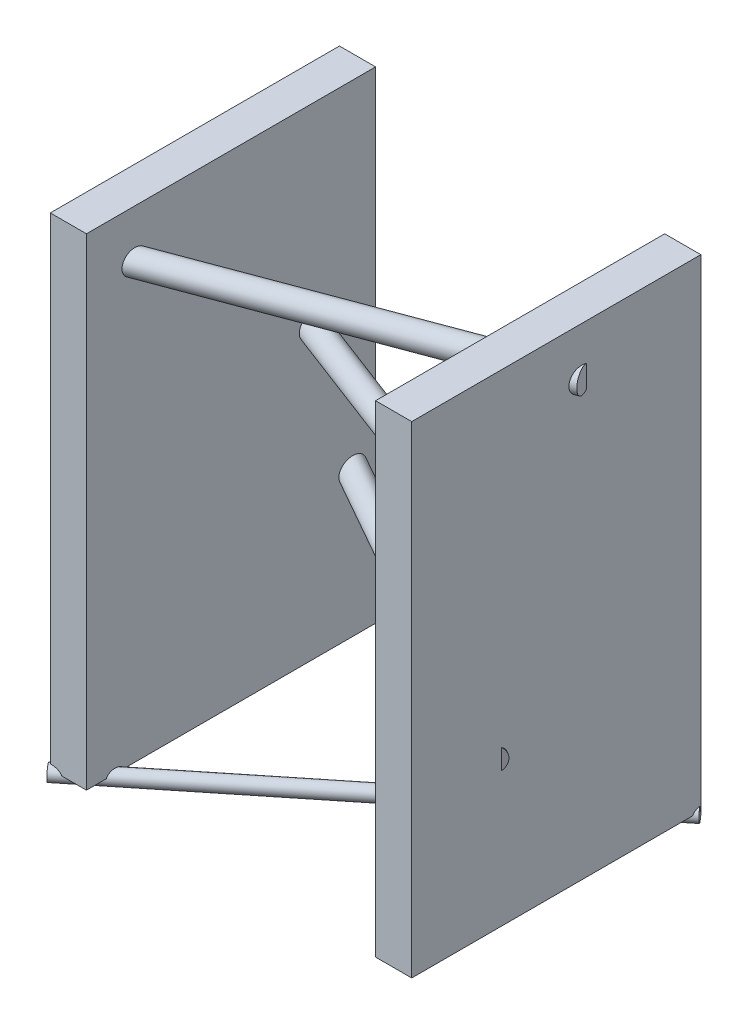
ISO-10303-21;
HEADER;
FILE_DESCRIPTION(('STEP AP214'),'2;1');
FILE_NAME('part.step','',(''),(''),'','','');
FILE_SCHEMA(('AUTOMOTIVE_DESIGN { 1 0 10303 214 1 1 1 1 }'));
ENDSEC;
DATA;
#1=APPLICATION_CONTEXT('core data for automotive mechanical design processes');
#2=APPLICATION_PROTOCOL_DEFINITION('international standard','automotive_design',2000,#1);
#3=PRODUCT_CONTEXT('',#1,'mechanical');
#4=PRODUCT('Part','Part','',(#3));
#5=PRODUCT_RELATED_PRODUCT_CATEGORY('part','',(#4));
#6=PRODUCT_DEFINITION_FORMATION('','',#4);
#7=PRODUCT_DEFINITION_CONTEXT('part definition',#1,'design');
#8=PRODUCT_DEFINITION('design','',#6,#7);
#9=PRODUCT_DEFINITION_SHAPE('','',#8);
#10=(LENGTH_UNIT() NAMED_UNIT(*) SI_UNIT(.MILLI.,.METRE.));
#11=(NAMED_UNIT(*) PLANE_ANGLE_UNIT() SI_UNIT($,.RADIAN.));
#12=(NAMED_UNIT(*) SI_UNIT($,.STERADIAN.) SOLID_ANGLE_UNIT());
#13=UNCERTAINTY_MEASURE_WITH_UNIT(LENGTH_MEASURE(1.E-05),#10,'distance_accuracy_value','');
#14=(GEOMETRIC_REPRESENTATION_CONTEXT(3) GLOBAL_UNCERTAINTY_ASSIGNED_CONTEXT((#13)) GLOBAL_UNIT_ASSIGNED_CONTEXT((#10,
#11,#12)) REPRESENTATION_CONTEXT('',''));
#15=CARTESIAN_POINT('',(0.,0.,0.));
#16=DIRECTION('',(0.,0.,1.));
#17=DIRECTION('',(1.,0.,0.));
#18=AXIS2_PLACEMENT_3D('',#15,#16,#17);
#19=CARTESIAN_POINT('',(750.,-1000.,1200.));
#20=DIRECTION('',(-1.,0.,0.));
#21=DIRECTION('',(0.,0.,1.));
#22=AXIS2_PLACEMENT_3D('',#19,#20,#21);
#23=PLANE('',#22);
#24=DIRECTION('',(0.,-1.,0.));
#25=VECTOR('',#24,1.);
#26=CARTESIAN_POINT('',(750.,-1000.,826.92968682027));
#27=LINE('',#26,#25);
#28=CARTESIAN_POINT('',(750.,-358.417396383127,826.92968682027));
#29=VERTEX_POINT('',#28);
#30=CARTESIAN_POINT('',(750.,-441.582603616873,826.92968682027));
#31=VERTEX_POINT('',#30);
#32=EDGE_CURVE('E193',#29,#31,#27,.T.);
#33=ORIENTED_EDGE('',*,*,#32,.F.);
#34=CARTESIAN_POINT('',(750.,-400.,858.830722776159));
#35=DIRECTION('',(-1.,0.,0.));
#36=DIRECTION('',(0.,0.,-1.));
#37=AXIS2_PLACEMENT_3D('',#34,#35,#36);
#38=ELLIPSE('',#37,57.4485945583379,50.);
#39=EDGE_CURVE('E204',#29,#31,#38,.T.);
#40=ORIENTED_EDGE('',*,*,#39,.T.);
#41=EDGE_LOOP('',(#33,#40));
#42=FACE_BOUND('',#41,.T.);
#43=CARTESIAN_POINT('',(750.,-1010.,-2.80330925717217));
#44=DIRECTION('',(-1.,0.,0.));
#45=DIRECTION('',(0.,0.,1.));
#46=AXIS2_PLACEMENT_3D('',#43,#44,#45);
#47=ELLIPSE('',#46,38.4791760452206,30.);
#48=CARTESIAN_POINT('',(750.,-980.522224187919,4.3451156705082));
#49=VERTEX_POINT('',#48);
#50=CARTESIAN_POINT('',(750.,-1000.,33.47520583089));
#51=VERTEX_POINT('',#50);
#52=EDGE_CURVE('E196',#49,#51,#47,.F.);
#53=ORIENTED_EDGE('',*,*,#52,.F.);
#54=DIRECTION('',(0.,-1.,0.));
#55=VECTOR('',#54,1.);
#56=CARTESIAN_POINT('',(750.,-1010.,4.34511567050816));
#57=LINE('',#56,#55);
#58=CARTESIAN_POINT('',(750.,-1000.,4.34511567050883));
#59=VERTEX_POINT('',#58);
#60=EDGE_CURVE('E275',#49,#59,#57,.T.);
#61=ORIENTED_EDGE('',*,*,#60,.T.);
#62=DIRECTION('',(0.,0.,-1.));
#63=VECTOR('',#62,1.);
#64=CARTESIAN_POINT('',(750.,-1000.,1200.));
#65=LINE('',#64,#63);
#66=CARTESIAN_POINT('',(750.,-1000.,0.));
#67=VERTEX_POINT('',#66);
#68=EDGE_CURVE('E284',#59,#67,#65,.T.);
#69=ORIENTED_EDGE('',*,*,#68,.T.);
#70=DIRECTION('',(0.,1.,0.));
#71=VECTOR('',#70,1.);
#72=CARTESIAN_POINT('',(750.,-1000.,0.));
#73=LINE('',#72,#71);
#74=CARTESIAN_POINT('',(750.,1000.,0.));
#75=VERTEX_POINT('',#74);
#76=EDGE_CURVE('E293',#67,#75,#73,.T.);
#77=ORIENTED_EDGE('',*,*,#76,.T.);
#78=DIRECTION('',(0.,0.,-1.));
#79=VECTOR('',#78,1.);
#80=CARTESIAN_POINT('',(750.,1000.,1200.));
#81=LINE('',#80,#79);
#82=CARTESIAN_POINT('',(750.,1000.,1200.));
#83=VERTEX_POINT('',#82);
#84=EDGE_CURVE('E285',#83,#75,#81,.T.);
#85=ORIENTED_EDGE('',*,*,#84,.F.);
#86=DIRECTION('',(0.,1.,0.));
#87=VECTOR('',#86,1.);
#88=CARTESIAN_POINT('',(750.,-1000.,1200.));
#89=LINE('',#88,#87);
#90=CARTESIAN_POINT('',(750.,-1000.,1200.));
#91=VERTEX_POINT('',#90);
#92=EDGE_CURVE('E301',#91,#83,#89,.T.);
#93=ORIENTED_EDGE('',*,*,#92,.F.);
#94=EDGE_CURVE('E281',#91,#51,#65,.T.);
#95=ORIENTED_EDGE('',*,*,#94,.T.);
#96=EDGE_LOOP('',(#53,#61,#69,#77,#85,#93,#95));
#97=FACE_BOUND('',#96,.T.);
#98=DIRECTION('',(0.,1.,0.));
#99=VECTOR('',#98,1.);
#100=CARTESIAN_POINT('',(750.,-1000.,475.262492550542));
#101=LINE('',#100,#99);
#102=CARTESIAN_POINT('',(750.,753.241302990832,475.262492550543));
#103=VERTEX_POINT('',#102);
#104=CARTESIAN_POINT('',(750.,846.758697009168,475.262492550543));
#105=VERTEX_POINT('',#104);
#106=EDGE_CURVE('E12',#103,#105,#101,.T.);
#107=ORIENTED_EDGE('',*,*,#106,.F.);
#108=CARTESIAN_POINT('',(750.,800.,494.170004104978));
#109=DIRECTION('',(-1.,0.,0.));
#110=DIRECTION('',(0.,0.,1.));
#111=AXIS2_PLACEMENT_3D('',#108,#109,#110);
#112=ELLIPSE('',#111,53.3825798254908,50.);
#113=EDGE_CURVE('E184',#103,#105,#112,.T.);
#114=ORIENTED_EDGE('',*,*,#113,.T.);
#115=EDGE_LOOP('',(#107,#114));
#116=FACE_BOUND('',#115,.T.);
#117=ADVANCED_FACE('F57',(#42,#97,#116),#23,.F.);
#118=CARTESIAN_POINT('',(746.509913613874,-1010.,-1.66533453693773E-13));
#119=DIRECTION('',(-0.779642473756301,0.,0.626224890207309));
#120=DIRECTION('',(0.626224890207309,0.,0.779642473756301));
#121=AXIS2_PLACEMENT_3D('',#118,#119,#120);
#122=PLANE('',#121);
#123=ORIENTED_EDGE('',*,*,#60,.F.);
#124=CARTESIAN_POINT('',(746.509913613874,-1010.,-1.66533453693773E-13));
#125=DIRECTION('',(-0.779642473756301,0.,0.626224890207309));
#126=DIRECTION('',(0.626224890207309,0.,0.779642473756301));
#127=AXIS2_PLACEMENT_3D('',#124,#125,#126);
#128=CIRCLE('',#127,30.);
#129=CARTESIAN_POINT('',(746.509913613874,-980.,0.));
#130=VERTEX_POINT('',#129);
#131=EDGE_CURVE('E272',#130,#49,#128,.T.);
#132=ORIENTED_EDGE('',*,*,#131,.F.);
#133=DIRECTION('',(0.,1.,0.));
#134=VECTOR('',#133,1.);
#135=CARTESIAN_POINT('',(746.509913613874,-1010.,-1.66533453693773E-13));
#136=LINE('',#135,#134);
#137=CARTESIAN_POINT('',(746.509913613874,-1000.,0.));
#138=VERTEX_POINT('',#137);
#139=EDGE_CURVE('E277',#138,#130,#136,.T.);
#140=ORIENTED_EDGE('',*,*,#139,.F.);
#141=DIRECTION('',(-0.626224890207309,0.,-0.779642473756301));
#142=VECTOR('',#141,1.);
#143=CARTESIAN_POINT('',(746.509913613874,-1000.,-1.65088979867753E-13));
#144=LINE('',#143,#142);
#145=EDGE_CURVE('E279',#59,#138,#144,.T.);
#146=ORIENTED_EDGE('',*,*,#145,.F.);
#147=EDGE_LOOP('',(#123,#132,#140,#146));
#148=FACE_BOUND('',#147,.T.);
#149=ADVANCED_FACE('F357',(#148),#122,.F.);
#150=CARTESIAN_POINT('',(746.509913613874,-1010.,-1.66533453693773E-13));
#151=DIRECTION('',(-0.779642473756301,0.,0.626224890207309));
#152=DIRECTION('',(0.626224890207309,0.,0.779642473756301));
#153=AXIS2_PLACEMENT_3D('',#150,#151,#152);
#154=CYLINDRICAL_SURFACE('',#153,30.);
#155=DIRECTION('',(-0.779642473756301,0.,0.626224890207309));
#156=VECTOR('',#155,1.);
#157=CARTESIAN_POINT('',(764.22222827041,-1000.,22.0516192037653));
#158=LINE('',#157,#156);
#159=CARTESIAN_POINT('',(-702.309370716624,-1000.,1200.));
#160=VERTEX_POINT('',#159);
#161=CARTESIAN_POINT('',(-600.,-1000.,1117.82300656926));
#162=VERTEX_POINT('',#161);
#163=EDGE_CURVE('E266',#160,#162,#158,.F.);
#164=ORIENTED_EDGE('',*,*,#163,.F.);
#165=CARTESIAN_POINT('',(-747.47568666759,-1010.,1200.));
#166=DIRECTION('',(0.,0.,1.));
#167=DIRECTION('',(-1.,0.,0.));
#168=AXIS2_PLACEMENT_3D('',#165,#166,#167);
#169=ELLIPSE('',#168,47.9061124352126,30.);
#170=CARTESIAN_POINT('',(-750.,-980.041677119594,1200.));
#171=VERTEX_POINT('',#170);
#172=EDGE_CURVE('E228',#160,#171,#169,.T.);
#173=ORIENTED_EDGE('',*,*,#172,.T.);
#174=CARTESIAN_POINT('',(-750.,-1010.,1202.02758045213));
#175=DIRECTION('',(1.,0.,0.));
#176=DIRECTION('',(0.,0.,1.));
#177=AXIS2_PLACEMENT_3D('',#174,#175,#176);
#178=ELLIPSE('',#177,38.4791760452206,30.);
#179=CARTESIAN_POINT('',(-750.,-1000.,1165.74906536407));
#180=VERTEX_POINT('',#179);
#181=EDGE_CURVE('E260',#180,#171,#178,.T.);
#182=ORIENTED_EDGE('',*,*,#181,.F.);
#183=DIRECTION('',(-0.779642473756301,0.,0.626224890207309));
#184=VECTOR('',#183,1.);
#185=CARTESIAN_POINT('',(728.797598957339,-1000.,-22.0516192037656));
#186=LINE('',#185,#184);
#187=CARTESIAN_POINT('',(-600.,-1000.,1045.26597639314));
#188=VERTEX_POINT('',#187);
#189=EDGE_CURVE('E263',#188,#180,#186,.T.);
#190=ORIENTED_EDGE('',*,*,#189,.F.);
#191=CARTESIAN_POINT('',(-600.,-1010.,1081.5444914812));
#192=DIRECTION('',(-1.,0.,0.));
#193=DIRECTION('',(0.,0.,1.));
#194=AXIS2_PLACEMENT_3D('',#191,#192,#193);
#195=ELLIPSE('',#194,38.4791760452206,30.);
#196=EDGE_CURVE('E220',#162,#188,#195,.T.);
#197=ORIENTED_EDGE('',*,*,#196,.F.);
#198=EDGE_LOOP('',(#164,#173,#182,#190,#197));
#199=FACE_BOUND('',#198,.T.);
#200=CARTESIAN_POINT('',(-754.169659326706,-1010.,1205.37673668972));
#201=DIRECTION('',(-0.779642473756301,0.,0.626224890207309));
#202=DIRECTION('',(0.626224890207309,0.,0.779642473756301));
#203=AXIS2_PLACEMENT_3D('',#200,#201,#202);
#204=CIRCLE('',#203,30.);
#205=CARTESIAN_POINT('',(-735.382912620487,-1010.,1228.7660109024));
#206=VERTEX_POINT('',#205);
#207=EDGE_CURVE('E269',#206,#206,#204,.T.);
#208=ORIENTED_EDGE('',*,*,#207,.F.);
#209=EDGE_LOOP('',(#208));
#210=FACE_BOUND('',#209,.T.);
#211=ORIENTED_EDGE('',*,*,#131,.T.);
#212=ORIENTED_EDGE('',*,*,#52,.T.);
#213=DIRECTION('',(-0.779642473756301,0.,0.626224890207309));
#214=VECTOR('',#213,1.);
#215=CARTESIAN_POINT('',(764.22222827041,-1000.,22.0516192037653));
#216=LINE('',#215,#214);
#217=CARTESIAN_POINT('',(600.,-1000.,153.95829480182));
#218=VERTEX_POINT('',#217);
#219=EDGE_CURVE('E214',#51,#218,#216,.T.);
#220=ORIENTED_EDGE('',*,*,#219,.T.);
#221=CARTESIAN_POINT('',(600.,-1010.,117.679779713758));
#222=DIRECTION('',(1.,0.,0.));
#223=DIRECTION('',(0.,0.,1.));
#224=AXIS2_PLACEMENT_3D('',#221,#222,#223);
#225=ELLIPSE('',#224,38.4791760452206,30.);
#226=CARTESIAN_POINT('',(600.,-1000.,81.4012646256959));
#227=VERTEX_POINT('',#226);
#228=EDGE_CURVE('E217',#218,#227,#225,.F.);
#229=ORIENTED_EDGE('',*,*,#228,.T.);
#230=DIRECTION('',(-0.779642473756301,0.,0.626224890207309));
#231=VECTOR('',#230,1.);
#232=CARTESIAN_POINT('',(728.797598957339,-1000.,-22.0516192037656));
#233=LINE('',#232,#231);
#234=CARTESIAN_POINT('',(701.343597662909,-1000.,0.));
#235=VERTEX_POINT('',#234);
#236=EDGE_CURVE('E211',#227,#235,#233,.F.);
#237=ORIENTED_EDGE('',*,*,#236,.T.);
#238=CARTESIAN_POINT('',(746.509913613874,-1010.,0.));
#239=DIRECTION('',(0.,0.,1.));
#240=DIRECTION('',(-1.,0.,0.));
#241=AXIS2_PLACEMENT_3D('',#238,#239,#240);
#242=ELLIPSE('',#241,47.9061124352126,30.);
#243=EDGE_CURVE('E208',#235,#130,#242,.F.);
#244=ORIENTED_EDGE('',*,*,#243,.T.);
#245=EDGE_LOOP('',(#211,#212,#220,#229,#237,#244));
#246=FACE_BOUND('',#245,.T.);
#247=ADVANCED_FACE('F363',(#199,#210,#246),#154,.T.);
#248=CARTESIAN_POINT('',(750.,-1000.,1200.));
#249=DIRECTION('',(0.,1.,0.));
#250=DIRECTION('',(-1.,0.,0.));
#251=AXIS2_PLACEMENT_3D('',#248,#249,#250);
#252=PLANE('',#251);
#253=DIRECTION('',(0.,0.,-1.));
#254=VECTOR('',#253,1.);
#255=CARTESIAN_POINT('',(-600.,-1000.,0.));
#256=LINE('',#255,#254);
#257=CARTESIAN_POINT('',(-600.,-1000.,0.));
#258=VERTEX_POINT('',#257);
#259=EDGE_CURVE('E243',#188,#258,#256,.T.);
#260=ORIENTED_EDGE('',*,*,#259,.F.);
#261=ORIENTED_EDGE('',*,*,#189,.T.);
#262=DIRECTION('',(0.,0.,-1.));
#263=VECTOR('',#262,1.);
#264=CARTESIAN_POINT('',(-750.,-1000.,1200.));
#265=LINE('',#264,#263);
#266=CARTESIAN_POINT('',(-750.,-1000.,0.));
#267=VERTEX_POINT('',#266);
#268=EDGE_CURVE('E227',#180,#267,#265,.T.);
#269=ORIENTED_EDGE('',*,*,#268,.T.);
#270=DIRECTION('',(1.,0.,0.));
#271=VECTOR('',#270,1.);
#272=CARTESIAN_POINT('',(750.,-1000.,0.));
#273=LINE('',#272,#271);
#274=EDGE_CURVE('E224',#267,#258,#273,.T.);
#275=ORIENTED_EDGE('',*,*,#274,.T.);
#276=EDGE_LOOP('',(#260,#261,#269,#275));
#277=FACE_BOUND('',#276,.T.);
#278=ADVANCED_FACE('F380',(#277),#252,.F.);
#279=DIRECTION('',(1.,0.,0.));
#280=VECTOR('',#279,1.);
#281=CARTESIAN_POINT('',(750.,-1000.,1200.));
#282=LINE('',#281,#280);
#283=CARTESIAN_POINT('',(-600.,-1000.,1200.));
#284=VERTEX_POINT('',#283);
#285=EDGE_CURVE('E233',#160,#284,#282,.T.);
#286=ORIENTED_EDGE('',*,*,#285,.F.);
#287=ORIENTED_EDGE('',*,*,#163,.T.);
#288=EDGE_CURVE('E240',#284,#162,#256,.T.);
#289=ORIENTED_EDGE('',*,*,#288,.F.);
#290=EDGE_LOOP('',(#286,#287,#289));
#291=FACE_BOUND('',#290,.T.);
#292=ADVANCED_FACE('F59',(#291),#252,.F.);
#293=CARTESIAN_POINT('',(750.,1000.,1200.));
#294=DIRECTION('',(0.,-1.,0.));
#295=DIRECTION('',(0.,0.,-1.));
#296=AXIS2_PLACEMENT_3D('',#293,#294,#295);
#297=PLANE('',#296);
#298=DIRECTION('',(-1.,0.,0.));
#299=VECTOR('',#298,1.);
#300=CARTESIAN_POINT('',(750.,1000.,1200.));
#301=LINE('',#300,#299);
#302=CARTESIAN_POINT('',(-600.,1000.,1200.));
#303=VERTEX_POINT('',#302);
#304=CARTESIAN_POINT('',(-750.,1000.,1200.));
#305=VERTEX_POINT('',#304);
#306=EDGE_CURVE('E231',#303,#305,#301,.T.);
#307=ORIENTED_EDGE('',*,*,#306,.F.);
#308=DIRECTION('',(0.,0.,-1.));
#309=VECTOR('',#308,1.);
#310=CARTESIAN_POINT('',(-600.,1000.,0.));
#311=LINE('',#310,#309);
#312=CARTESIAN_POINT('',(-600.,1000.,0.));
#313=VERTEX_POINT('',#312);
#314=EDGE_CURVE('E232',#303,#313,#311,.T.);
#315=ORIENTED_EDGE('',*,*,#314,.T.);
#316=DIRECTION('',(-1.,0.,0.));
#317=VECTOR('',#316,1.);
#318=CARTESIAN_POINT('',(750.,1000.,0.));
#319=LINE('',#318,#317);
#320=CARTESIAN_POINT('',(-750.,1000.,0.));
#321=VERTEX_POINT('',#320);
#322=EDGE_CURVE('E229',#313,#321,#319,.T.);
#323=ORIENTED_EDGE('',*,*,#322,.T.);
#324=DIRECTION('',(0.,0.,-1.));
#325=VECTOR('',#324,1.);
#326=CARTESIAN_POINT('',(-750.,1000.,1200.));
#327=LINE('',#326,#325);
#328=EDGE_CURVE('E254',#305,#321,#327,.T.);
#329=ORIENTED_EDGE('',*,*,#328,.F.);
#330=EDGE_LOOP('',(#307,#315,#323,#329));
#331=FACE_BOUND('',#330,.T.);
#332=ADVANCED_FACE('F396',(#331),#297,.F.);
#333=CARTESIAN_POINT('',(0.,0.,1200.));
#334=DIRECTION('',(0.,0.,1.));
#335=DIRECTION('',(1.,0.,0.));
#336=AXIS2_PLACEMENT_3D('',#333,#334,#335);
#337=PLANE('',#336);
#338=ORIENTED_EDGE('',*,*,#172,.F.);
#339=ORIENTED_EDGE('',*,*,#285,.T.);
#340=DIRECTION('',(0.,-1.,0.));
#341=VECTOR('',#340,1.);
#342=CARTESIAN_POINT('',(-600.,1000.,1200.));
#343=LINE('',#342,#341);
#344=EDGE_CURVE('E223',#303,#284,#343,.T.);
#345=ORIENTED_EDGE('',*,*,#344,.F.);
#346=ORIENTED_EDGE('',*,*,#306,.T.);
#347=DIRECTION('',(0.,-1.,0.));
#348=VECTOR('',#347,1.);
#349=CARTESIAN_POINT('',(-750.,-1000.,1200.));
#350=LINE('',#349,#348);
#351=EDGE_CURVE('E236',#305,#171,#350,.T.);
#352=ORIENTED_EDGE('',*,*,#351,.T.);
#353=EDGE_LOOP('',(#338,#339,#345,#346,#352));
#354=FACE_BOUND('',#353,.T.);
#355=ADVANCED_FACE('F393',(#354),#337,.T.);
#356=CARTESIAN_POINT('',(0.,0.,0.));
#357=DIRECTION('',(0.,0.,1.));
#358=DIRECTION('',(1.,0.,0.));
#359=AXIS2_PLACEMENT_3D('',#356,#357,#358);
#360=PLANE('',#359);
#361=DIRECTION('',(0.,-1.,0.));
#362=VECTOR('',#361,1.);
#363=CARTESIAN_POINT('',(-750.,-1000.,0.));
#364=LINE('',#363,#362);
#365=CARTESIAN_POINT('',(-750.,-449.217826733663,0.));
#366=VERTEX_POINT('',#365);
#367=EDGE_CURVE('E248',#366,#267,#364,.T.);
#368=ORIENTED_EDGE('',*,*,#367,.F.);
#369=CARTESIAN_POINT('',(-767.889088403167,-400.,0.));
#370=DIRECTION('',(0.,0.,1.));
#371=DIRECTION('',(-1.,0.,0.));
#372=AXIS2_PLACEMENT_3D('',#369,#370,#371);
#373=ELLIPSE('',#372,101.534088746061,50.);
#374=CARTESIAN_POINT('',(-750.,-350.782173266337,0.));
#375=VERTEX_POINT('',#374);
#376=EDGE_CURVE('E315',#366,#375,#373,.T.);
#377=ORIENTED_EDGE('',*,*,#376,.T.);
#378=EDGE_CURVE('E251',#321,#375,#364,.T.);
#379=ORIENTED_EDGE('',*,*,#378,.F.);
#380=ORIENTED_EDGE('',*,*,#322,.F.);
#381=DIRECTION('',(0.,-1.,0.));
#382=VECTOR('',#381,1.);
#383=CARTESIAN_POINT('',(-600.,1000.,0.));
#384=LINE('',#383,#382);
#385=EDGE_CURVE('E235',#313,#258,#384,.T.);
#386=ORIENTED_EDGE('',*,*,#385,.T.);
#387=ORIENTED_EDGE('',*,*,#274,.F.);
#388=EDGE_LOOP('',(#368,#377,#379,#380,#386,#387));
#389=FACE_BOUND('',#388,.T.);
#390=ADVANCED_FACE('F390',(#389),#360,.F.);
#391=CARTESIAN_POINT('',(-750.,-1000.,1200.));
#392=DIRECTION('',(1.,0.,0.));
#393=DIRECTION('',(0.,0.,-1.));
#394=AXIS2_PLACEMENT_3D('',#391,#392,#393);
#395=PLANE('',#394);
#396=CARTESIAN_POINT('',(-750.,800.,1055.17788813372));
#397=DIRECTION('',(1.,0.,0.));
#398=DIRECTION('',(0.,0.,1.));
#399=AXIS2_PLACEMENT_3D('',#396,#397,#398);
#400=ELLIPSE('',#399,53.3825798254908,50.);
#401=CARTESIAN_POINT('',(-750.,756.395107903488,1081.29966802318));
#402=VERTEX_POINT('',#401);
#403=CARTESIAN_POINT('',(-750.,843.604892096511,1081.29966802318));
#404=VERTEX_POINT('',#403);
#405=EDGE_CURVE('E180',#402,#404,#400,.T.);
#406=ORIENTED_EDGE('',*,*,#405,.T.);
#407=DIRECTION('',(0.,-1.,0.));
#408=VECTOR('',#407,1.);
#409=CARTESIAN_POINT('',(-750.,-1000.,1081.29966802318));
#410=LINE('',#409,#408);
#411=EDGE_CURVE('E66',#404,#402,#410,.T.);
#412=ORIENTED_EDGE('',*,*,#411,.T.);
#413=EDGE_LOOP('',(#406,#412));
#414=FACE_BOUND('',#413,.T.);
#415=ORIENTED_EDGE('',*,*,#378,.T.);
#416=CARTESIAN_POINT('',(-750.,-400.,10.1217531903214));
#417=DIRECTION('',(1.,0.,0.));
#418=DIRECTION('',(0.,0.,-1.));
#419=AXIS2_PLACEMENT_3D('',#416,#417,#418);
#420=ELLIPSE('',#419,57.4485945583379,50.);
#421=EDGE_CURVE('E318',#375,#366,#420,.T.);
#422=ORIENTED_EDGE('',*,*,#421,.T.);
#423=ORIENTED_EDGE('',*,*,#367,.T.);
#424=ORIENTED_EDGE('',*,*,#268,.F.);
#425=ORIENTED_EDGE('',*,*,#181,.T.);
#426=ORIENTED_EDGE('',*,*,#351,.F.);
#427=ORIENTED_EDGE('',*,*,#328,.T.);
#428=EDGE_LOOP('',(#415,#422,#423,#424,#425,#426,#427));
#429=FACE_BOUND('',#428,.T.);
#430=ADVANCED_FACE('F191',(#414,#429),#395,.F.);
#431=CARTESIAN_POINT('',(-600.,1000.,0.));
#432=DIRECTION('',(-1.,0.,0.));
#433=DIRECTION('',(0.,-1.,0.));
#434=AXIS2_PLACEMENT_3D('',#431,#432,#433);
#435=PLANE('',#434);
#436=CARTESIAN_POINT('',(-600.,200.,263.198414803595));
#437=DIRECTION('',(-1.,0.,0.));
#438=DIRECTION('',(0.,0.,-1.));
#439=AXIS2_PLACEMENT_3D('',#436,#437,#438);
#440=ELLIPSE('',#439,53.5076626037398,50.);
#441=CARTESIAN_POINT('',(-600.,200.,209.690752199855));
#442=VERTEX_POINT('',#441);
#443=EDGE_CURVE('E335',#442,#442,#440,.T.);
#444=ORIENTED_EDGE('',*,*,#443,.T.);
#445=EDGE_LOOP('',(#444));
#446=FACE_BOUND('',#445,.T.);
#447=CARTESIAN_POINT('',(-600.,800.,999.077099730843));
#448=DIRECTION('',(-1.,0.,0.));
#449=DIRECTION('',(0.,0.,1.));
#450=AXIS2_PLACEMENT_3D('',#447,#448,#449);
#451=ELLIPSE('',#450,53.3825798254908,50.);
#452=CARTESIAN_POINT('',(-600.,800.,1052.45967955633));
#453=VERTEX_POINT('',#452);
#454=EDGE_CURVE('E185',#453,#453,#451,.T.);
#455=ORIENTED_EDGE('',*,*,#454,.T.);
#456=EDGE_LOOP('',(#455));
#457=FACE_BOUND('',#456,.T.);
#458=CARTESIAN_POINT('',(-600.,-400.,94.992650148905));
#459=DIRECTION('',(-1.,0.,0.));
#460=DIRECTION('',(0.,0.,-1.));
#461=AXIS2_PLACEMENT_3D('',#458,#459,#460);
#462=ELLIPSE('',#461,57.4485945583379,50.);
#463=CARTESIAN_POINT('',(-600.,-400.,37.5440555905671));
#464=VERTEX_POINT('',#463);
#465=EDGE_CURVE('E321',#464,#464,#462,.T.);
#466=ORIENTED_EDGE('',*,*,#465,.T.);
#467=EDGE_LOOP('',(#466));
#468=FACE_BOUND('',#467,.T.);
#469=ORIENTED_EDGE('',*,*,#288,.T.);
#470=ORIENTED_EDGE('',*,*,#196,.T.);
#471=ORIENTED_EDGE('',*,*,#259,.T.);
#472=ORIENTED_EDGE('',*,*,#385,.F.);
#473=ORIENTED_EDGE('',*,*,#314,.F.);
#474=ORIENTED_EDGE('',*,*,#344,.T.);
#475=EDGE_LOOP('',(#469,#470,#471,#472,#473,#474));
#476=FACE_BOUND('',#475,.T.);
#477=ADVANCED_FACE('F385',(#446,#457,#468,#476),#435,.F.);
#478=CARTESIAN_POINT('',(-754.169659326706,-1010.,1205.37673668972));
#479=DIRECTION('',(-0.779642473756301,0.,0.626224890207309));
#480=DIRECTION('',(0.626224890207309,0.,0.779642473756301));
#481=AXIS2_PLACEMENT_3D('',#478,#479,#480);
#482=PLANE('',#481);
#483=ORIENTED_EDGE('',*,*,#207,.T.);
#484=EDGE_LOOP('',(#483));
#485=FACE_BOUND('',#484,.T.);
#486=ADVANCED_FACE('F382',(#485),#482,.T.);
#487=CARTESIAN_POINT('',(0.,0.,0.));
#488=DIRECTION('',(0.,0.,1.));
#489=DIRECTION('',(1.,0.,0.));
#490=AXIS2_PLACEMENT_3D('',#487,#488,#489);
#491=PLANE('',#490);
#492=DIRECTION('',(1.,0.,0.));
#493=VECTOR('',#492,1.);
#494=CARTESIAN_POINT('',(750.,-1000.,0.));
#495=LINE('',#494,#493);
#496=EDGE_CURVE('E298',#138,#67,#495,.T.);
#497=ORIENTED_EDGE('',*,*,#496,.F.);
#498=ORIENTED_EDGE('',*,*,#139,.T.);
#499=ORIENTED_EDGE('',*,*,#243,.F.);
#500=CARTESIAN_POINT('',(600.,-1000.,0.));
#501=VERTEX_POINT('',#500);
#502=EDGE_CURVE('E295',#501,#235,#495,.T.);
#503=ORIENTED_EDGE('',*,*,#502,.F.);
#504=DIRECTION('',(0.,-1.,0.));
#505=VECTOR('',#504,1.);
#506=CARTESIAN_POINT('',(600.,1000.,0.));
#507=LINE('',#506,#505);
#508=CARTESIAN_POINT('',(600.,1000.,0.));
#509=VERTEX_POINT('',#508);
#510=EDGE_CURVE('E304',#509,#501,#507,.T.);
#511=ORIENTED_EDGE('',*,*,#510,.F.);
#512=DIRECTION('',(-1.,0.,0.));
#513=VECTOR('',#512,1.);
#514=CARTESIAN_POINT('',(750.,1000.,0.));
#515=LINE('',#514,#513);
#516=EDGE_CURVE('E289',#75,#509,#515,.T.);
#517=ORIENTED_EDGE('',*,*,#516,.F.);
#518=ORIENTED_EDGE('',*,*,#76,.F.);
#519=EDGE_LOOP('',(#497,#498,#499,#503,#511,#517,#518));
#520=FACE_BOUND('',#519,.T.);
#521=ADVANCED_FACE('F384',(#520),#491,.F.);
#522=CARTESIAN_POINT('',(750.,-1000.,1200.));
#523=DIRECTION('',(0.,1.,0.));
#524=DIRECTION('',(-1.,0.,0.));
#525=AXIS2_PLACEMENT_3D('',#522,#523,#524);
#526=PLANE('',#525);
#527=ORIENTED_EDGE('',*,*,#68,.F.);
#528=ORIENTED_EDGE('',*,*,#145,.T.);
#529=ORIENTED_EDGE('',*,*,#496,.T.);
#530=EDGE_LOOP('',(#527,#528,#529));
#531=FACE_BOUND('',#530,.T.);
#532=ADVANCED_FACE('F376',(#531),#526,.F.);
#533=ORIENTED_EDGE('',*,*,#236,.F.);
#534=DIRECTION('',(0.,0.,1.));
#535=VECTOR('',#534,1.);
#536=CARTESIAN_POINT('',(600.,-1000.,0.));
#537=LINE('',#536,#535);
#538=EDGE_CURVE('E310',#501,#227,#537,.T.);
#539=ORIENTED_EDGE('',*,*,#538,.F.);
#540=ORIENTED_EDGE('',*,*,#502,.T.);
#541=EDGE_LOOP('',(#533,#539,#540));
#542=FACE_BOUND('',#541,.T.);
#543=ADVANCED_FACE('F377',(#542),#526,.F.);
#544=CARTESIAN_POINT('',(0.,0.,1200.));
#545=DIRECTION('',(0.,0.,1.));
#546=DIRECTION('',(1.,0.,0.));
#547=AXIS2_PLACEMENT_3D('',#544,#545,#546);
#548=PLANE('',#547);
#549=DIRECTION('',(0.,-1.,0.));
#550=VECTOR('',#549,1.);
#551=CARTESIAN_POINT('',(600.,1000.,1200.));
#552=LINE('',#551,#550);
#553=CARTESIAN_POINT('',(600.,1000.,1200.));
#554=VERTEX_POINT('',#553);
#555=CARTESIAN_POINT('',(600.,-1000.,1200.));
#556=VERTEX_POINT('',#555);
#557=EDGE_CURVE('E306',#554,#556,#552,.T.);
#558=ORIENTED_EDGE('',*,*,#557,.T.);
#559=DIRECTION('',(1.,0.,0.));
#560=VECTOR('',#559,1.);
#561=CARTESIAN_POINT('',(750.,-1000.,1200.));
#562=LINE('',#561,#560);
#563=EDGE_CURVE('E292',#556,#91,#562,.T.);
#564=ORIENTED_EDGE('',*,*,#563,.T.);
#565=ORIENTED_EDGE('',*,*,#92,.T.);
#566=DIRECTION('',(-1.,0.,0.));
#567=VECTOR('',#566,1.);
#568=CARTESIAN_POINT('',(750.,1000.,1200.));
#569=LINE('',#568,#567);
#570=EDGE_CURVE('E288',#83,#554,#569,.T.);
#571=ORIENTED_EDGE('',*,*,#570,.T.);
#572=EDGE_LOOP('',(#558,#564,#565,#571));
#573=FACE_BOUND('',#572,.T.);
#574=ADVANCED_FACE('F545',(#573),#548,.T.);
#575=CARTESIAN_POINT('',(750.,1000.,1200.));
#576=DIRECTION('',(0.,-1.,0.));
#577=DIRECTION('',(0.,0.,-1.));
#578=AXIS2_PLACEMENT_3D('',#575,#576,#577);
#579=PLANE('',#578);
#580=ORIENTED_EDGE('',*,*,#516,.T.);
#581=DIRECTION('',(0.,0.,1.));
#582=VECTOR('',#581,1.);
#583=CARTESIAN_POINT('',(600.,1000.,0.));
#584=LINE('',#583,#582);
#585=EDGE_CURVE('E307',#509,#554,#584,.T.);
#586=ORIENTED_EDGE('',*,*,#585,.T.);
#587=ORIENTED_EDGE('',*,*,#570,.F.);
#588=ORIENTED_EDGE('',*,*,#84,.T.);
#589=EDGE_LOOP('',(#580,#586,#587,#588));
#590=FACE_BOUND('',#589,.T.);
#591=ADVANCED_FACE('F370',(#590),#579,.F.);
#592=ORIENTED_EDGE('',*,*,#219,.F.);
#593=ORIENTED_EDGE('',*,*,#94,.F.);
#594=ORIENTED_EDGE('',*,*,#563,.F.);
#595=EDGE_CURVE('E312',#218,#556,#537,.T.);
#596=ORIENTED_EDGE('',*,*,#595,.F.);
#597=EDGE_LOOP('',(#592,#593,#594,#596));
#598=FACE_BOUND('',#597,.T.);
#599=ADVANCED_FACE('F372',(#598),#526,.F.);
#600=CARTESIAN_POINT('',(600.,1000.,0.));
#601=DIRECTION('',(1.,0.,0.));
#602=DIRECTION('',(0.,1.,0.));
#603=AXIS2_PLACEMENT_3D('',#600,#601,#602);
#604=PLANE('',#603);
#605=CARTESIAN_POINT('',(600.,200.,720.503887560935));
#606=DIRECTION('',(1.,0.,0.));
#607=DIRECTION('',(0.,0.,-1.));
#608=AXIS2_PLACEMENT_3D('',#605,#606,#607);
#609=ELLIPSE('',#608,53.5076626037398,50.);
#610=CARTESIAN_POINT('',(600.,200.,666.996224957196));
#611=VERTEX_POINT('',#610);
#612=EDGE_CURVE('E61',#611,#611,#609,.T.);
#613=ORIENTED_EDGE('',*,*,#612,.T.);
#614=EDGE_LOOP('',(#613));
#615=FACE_BOUND('',#614,.T.);
#616=CARTESIAN_POINT('',(600.,800.,550.270792507852));
#617=DIRECTION('',(1.,0.,0.));
#618=DIRECTION('',(0.,0.,1.));
#619=AXIS2_PLACEMENT_3D('',#616,#617,#618);
#620=ELLIPSE('',#619,53.3825798254908,50.);
#621=CARTESIAN_POINT('',(600.,800.,603.653372333343));
#622=VERTEX_POINT('',#621);
#623=EDGE_CURVE('E189',#622,#622,#620,.T.);
#624=ORIENTED_EDGE('',*,*,#623,.T.);
#625=EDGE_LOOP('',(#624));
#626=FACE_BOUND('',#625,.T.);
#627=CARTESIAN_POINT('',(600.,-400.,773.959825817575));
#628=DIRECTION('',(1.,0.,0.));
#629=DIRECTION('',(0.,0.,-1.));
#630=AXIS2_PLACEMENT_3D('',#627,#628,#629);
#631=ELLIPSE('',#630,57.4485945583379,50.);
#632=CARTESIAN_POINT('',(600.,-400.,716.511231259237));
#633=VERTEX_POINT('',#632);
#634=EDGE_CURVE('E201',#633,#633,#631,.T.);
#635=ORIENTED_EDGE('',*,*,#634,.T.);
#636=EDGE_LOOP('',(#635));
#637=FACE_BOUND('',#636,.T.);
#638=ORIENTED_EDGE('',*,*,#228,.F.);
#639=ORIENTED_EDGE('',*,*,#595,.T.);
#640=ORIENTED_EDGE('',*,*,#557,.F.);
#641=ORIENTED_EDGE('',*,*,#585,.F.);
#642=ORIENTED_EDGE('',*,*,#510,.T.);
#643=ORIENTED_EDGE('',*,*,#538,.T.);
#644=EDGE_LOOP('',(#638,#639,#640,#641,#642,#643));
#645=FACE_BOUND('',#644,.T.);
#646=ADVANCED_FACE('F342',(#615,#626,#637,#645),#604,.F.);
#647=CARTESIAN_POINT('',(736.327324349407,-400.,851.094641134229));
#648=DIRECTION('',(-0.870343310996513,0.,-0.492445449774518));
#649=DIRECTION('',(-0.492445449774518,0.,0.870343310996513));
#650=AXIS2_PLACEMENT_3D('',#647,#648,#649);
#651=CYLINDRICAL_SURFACE('',#650,50.);
#652=ORIENTED_EDGE('',*,*,#634,.F.);
#653=EDGE_LOOP('',(#652));
#654=FACE_BOUND('',#653,.T.);
#655=ORIENTED_EDGE('',*,*,#465,.F.);
#656=EDGE_LOOP('',(#655));
#657=FACE_BOUND('',#656,.T.);
#658=ADVANCED_FACE('F429',(#654,#657),#651,.T.);
#659=ORIENTED_EDGE('',*,*,#39,.F.);
#660=CARTESIAN_POINT('',(736.327324349407,-400.,851.094641134229));
#661=DIRECTION('',(-0.870343310996513,0.,-0.492445449774518));
#662=DIRECTION('',(-0.492445449774518,0.,0.870343310996513));
#663=AXIS2_PLACEMENT_3D('',#660,#661,#662);
#664=CIRCLE('',#663,50.);
#665=EDGE_CURVE('E328',#29,#31,#664,.T.);
#666=ORIENTED_EDGE('',*,*,#665,.T.);
#667=EDGE_LOOP('',(#659,#666));
#668=FACE_BOUND('',#667,.T.);
#669=ADVANCED_FACE('F430',(#668),#651,.T.);
#670=CARTESIAN_POINT('',(736.327324349407,-400.,851.094641134229));
#671=DIRECTION('',(-0.870343310996513,0.,-0.492445449774518));
#672=DIRECTION('',(-0.492445449774518,0.,0.870343310996513));
#673=AXIS2_PLACEMENT_3D('',#670,#671,#672);
#674=PLANE('',#673);
#675=ORIENTED_EDGE('',*,*,#665,.F.);
#676=ORIENTED_EDGE('',*,*,#32,.T.);
#677=EDGE_LOOP('',(#675,#676));
#678=FACE_BOUND('',#677,.T.);
#679=ADVANCED_FACE('F426',(#678),#674,.F.);
#680=CARTESIAN_POINT('',(-767.889088403167,-400.,0.));
#681=DIRECTION('',(-0.870343310996513,0.,-0.492445449774518));
#682=DIRECTION('',(-0.492445449774518,0.,0.870343310996513));
#683=AXIS2_PLACEMENT_3D('',#680,#681,#682);
#684=CIRCLE('',#683,50.);
#685=CARTESIAN_POINT('',(-792.511360891893,-400.,43.5171655498257));
#686=VERTEX_POINT('',#685);
#687=EDGE_CURVE('E205',#686,#686,#684,.T.);
#688=ORIENTED_EDGE('',*,*,#687,.F.);
#689=EDGE_LOOP('',(#688));
#690=FACE_BOUND('',#689,.T.);
#691=ORIENTED_EDGE('',*,*,#376,.F.);
#692=ORIENTED_EDGE('',*,*,#421,.F.);
#693=EDGE_LOOP('',(#691,#692));
#694=FACE_BOUND('',#693,.T.);
#695=ADVANCED_FACE('F423',(#690,#694),#651,.T.);
#696=CARTESIAN_POINT('',(-767.889088403167,-400.,0.));
#697=DIRECTION('',(-0.870343310996513,0.,-0.492445449774518));
#698=DIRECTION('',(-0.492445449774518,0.,0.870343310996513));
#699=AXIS2_PLACEMENT_3D('',#696,#697,#698);
#700=PLANE('',#699);
#701=ORIENTED_EDGE('',*,*,#687,.T.);
#702=EDGE_LOOP('',(#701));
#703=FACE_BOUND('',#702,.T.);
#704=ADVANCED_FACE('F425',(#703),#700,.T.);
#705=CARTESIAN_POINT('',(756.20373120361,800.,491.849776027898));
#706=DIRECTION('',(-0.936635137594539,0.,0.350306464432586));
#707=DIRECTION('',(0.350306464432586,0.,0.936635137594539));
#708=AXIS2_PLACEMENT_3D('',#705,#706,#707);
#709=CYLINDRICAL_SURFACE('',#708,50.);
#710=ORIENTED_EDGE('',*,*,#623,.F.);
#711=EDGE_LOOP('',(#710));
#712=FACE_BOUND('',#711,.T.);
#713=ORIENTED_EDGE('',*,*,#454,.F.);
#714=EDGE_LOOP('',(#713));
#715=FACE_BOUND('',#714,.T.);
#716=ADVANCED_FACE('F355',(#712,#715),#709,.T.);
#717=ORIENTED_EDGE('',*,*,#405,.F.);
#718=CARTESIAN_POINT('',(-758.570800050951,800.,1058.38341240106));
#719=DIRECTION('',(-0.936635137594539,0.,0.350306464432586));
#720=DIRECTION('',(0.350306464432586,0.,0.936635137594539));
#721=AXIS2_PLACEMENT_3D('',#718,#719,#720);
#722=CIRCLE('',#721,50.);
#723=EDGE_CURVE('E78',#404,#402,#722,.T.);
#724=ORIENTED_EDGE('',*,*,#723,.F.);
#725=EDGE_LOOP('',(#717,#724));
#726=FACE_BOUND('',#725,.T.);
#727=ADVANCED_FACE('F181',(#726),#709,.T.);
#728=CARTESIAN_POINT('',(-758.570800050951,800.,1058.38341240106));
#729=DIRECTION('',(-0.936635137594539,0.,0.350306464432586));
#730=DIRECTION('',(0.350306464432586,0.,0.936635137594539));
#731=AXIS2_PLACEMENT_3D('',#728,#729,#730);
#732=PLANE('',#731);
#733=ORIENTED_EDGE('',*,*,#411,.F.);
#734=ORIENTED_EDGE('',*,*,#723,.T.);
#735=EDGE_LOOP('',(#733,#734));
#736=FACE_BOUND('',#735,.T.);
#737=ADVANCED_FACE('F188',(#736),#732,.T.);
#738=CARTESIAN_POINT('',(756.20373120361,800.,491.849776027898));
#739=DIRECTION('',(-0.936635137594539,0.,0.350306464432586));
#740=DIRECTION('',(0.350306464432586,0.,0.936635137594539));
#741=AXIS2_PLACEMENT_3D('',#738,#739,#740);
#742=PLANE('',#741);
#743=CARTESIAN_POINT('',(756.20373120361,800.,491.849776027898));
#744=DIRECTION('',(-0.936635137594539,0.,0.350306464432586));
#745=DIRECTION('',(0.350306464432586,0.,0.936635137594539));
#746=AXIS2_PLACEMENT_3D('',#743,#744,#745);
#747=CIRCLE('',#746,50.);
#748=EDGE_CURVE('E72',#103,#105,#747,.T.);
#749=ORIENTED_EDGE('',*,*,#748,.F.);
#750=ORIENTED_EDGE('',*,*,#106,.T.);
#751=EDGE_LOOP('',(#749,#750));
#752=FACE_BOUND('',#751,.T.);
#753=ADVANCED_FACE('F353',(#752),#742,.F.);
#754=ORIENTED_EDGE('',*,*,#113,.F.);
#755=ORIENTED_EDGE('',*,*,#748,.T.);
#756=EDGE_LOOP('',(#754,#755));
#757=FACE_BOUND('',#756,.T.);
#758=ADVANCED_FACE('F348',(#757),#709,.T.);
#759=CARTESIAN_POINT('',(726.419114790428,200.,768.68068177327));
#760=DIRECTION('',(-0.93444560212401,0.,-0.356105906537782));
#761=DIRECTION('',(-0.356105906537782,0.,0.934445602124011));
#762=AXIS2_PLACEMENT_3D('',#759,#760,#761);
#763=CYLINDRICAL_SURFACE('',#762,50.);
#764=ORIENTED_EDGE('',*,*,#612,.F.);
#765=EDGE_LOOP('',(#764));
#766=FACE_BOUND('',#765,.T.);
#767=ORIENTED_EDGE('',*,*,#443,.F.);
#768=EDGE_LOOP('',(#767));
#769=FACE_BOUND('',#768,.T.);
#770=ADVANCED_FACE('F345',(#766,#769),#763,.T.);
#771=CLOSED_SHELL('',(#117,#149,#247,#278,#292,#332,#355,#390,#430,#477,#486,#521,#532,#543,
#574,#591,#599,#646,#658,#669,#679,#695,#704,#716,#727,#737,#753,#758,#770));
#772=MANIFOLD_SOLID_BREP('B2',#771);
#773=ADVANCED_BREP_SHAPE_REPRESENTATION('',(#18,#772),#14);
#774=SHAPE_DEFINITION_REPRESENTATION(#9,#773);
ENDSEC;
END-ISO-10303-21;
